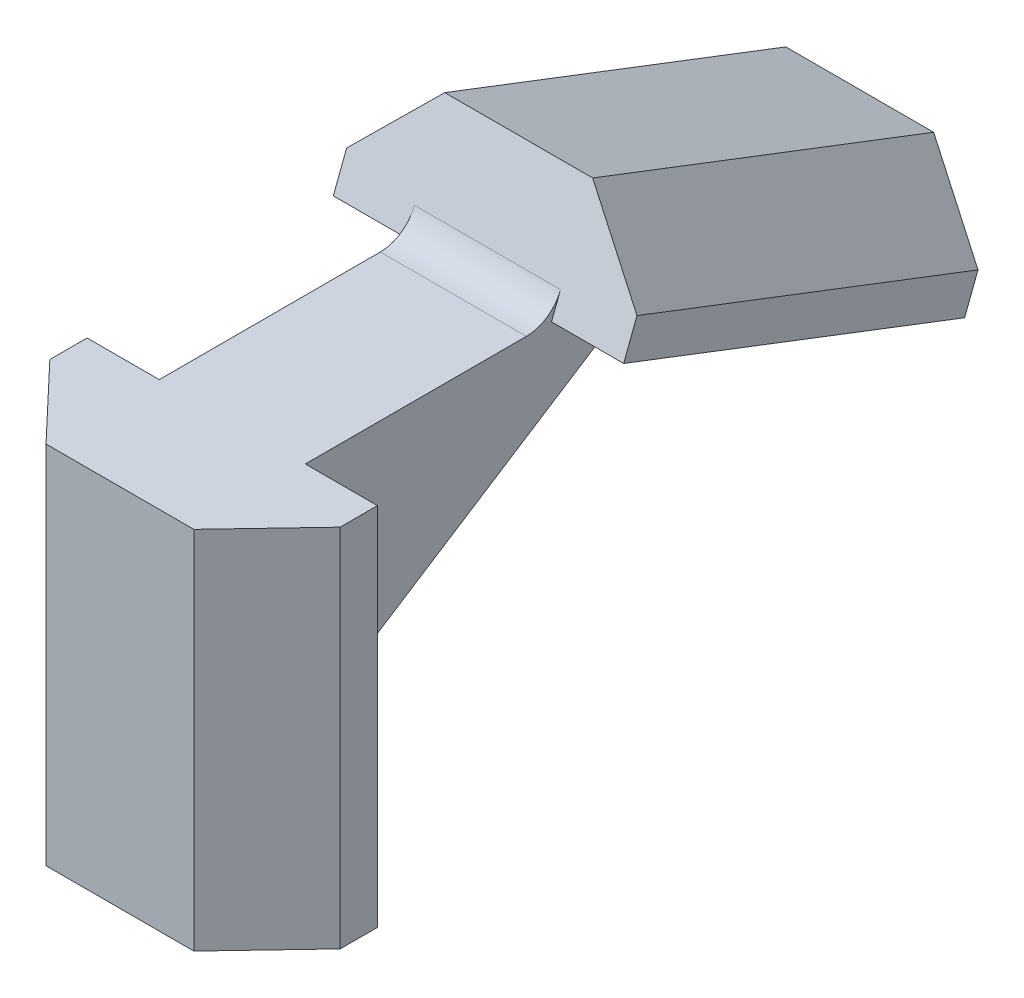
ISO-10303-21;
HEADER;
FILE_DESCRIPTION(('STEP AP214'),'2;1');
FILE_NAME('part.step','',(''),(''),'','','');
FILE_SCHEMA(('AUTOMOTIVE_DESIGN { 1 0 10303 214 1 1 1 1 }'));
ENDSEC;
DATA;
#1=APPLICATION_CONTEXT('core data for automotive mechanical design processes');
#2=APPLICATION_PROTOCOL_DEFINITION('international standard','automotive_design',2000,#1);
#3=PRODUCT_CONTEXT('',#1,'mechanical');
#4=PRODUCT('Part','Part','',(#3));
#5=PRODUCT_RELATED_PRODUCT_CATEGORY('part','',(#4));
#6=PRODUCT_DEFINITION_FORMATION('','',#4);
#7=PRODUCT_DEFINITION_CONTEXT('part definition',#1,'design');
#8=PRODUCT_DEFINITION('design','',#6,#7);
#9=PRODUCT_DEFINITION_SHAPE('','',#8);
#10=(LENGTH_UNIT() NAMED_UNIT(*) SI_UNIT(.MILLI.,.METRE.));
#11=(NAMED_UNIT(*) PLANE_ANGLE_UNIT() SI_UNIT($,.RADIAN.));
#12=(NAMED_UNIT(*) SI_UNIT($,.STERADIAN.) SOLID_ANGLE_UNIT());
#13=UNCERTAINTY_MEASURE_WITH_UNIT(LENGTH_MEASURE(1.E-05),#10,'distance_accuracy_value','');
#14=(GEOMETRIC_REPRESENTATION_CONTEXT(3) GLOBAL_UNCERTAINTY_ASSIGNED_CONTEXT((#13)) GLOBAL_UNIT_ASSIGNED_CONTEXT((#10,
#11,#12)) REPRESENTATION_CONTEXT('',''));
#15=CARTESIAN_POINT('',(0.,0.,0.));
#16=DIRECTION('',(0.,0.,1.));
#17=DIRECTION('',(1.,0.,0.));
#18=AXIS2_PLACEMENT_3D('',#15,#16,#17);
#19=CARTESIAN_POINT('',(-7.95,-20.,0.));
#20=DIRECTION('',(1.,0.,0.));
#21=DIRECTION('',(0.,0.,-1.));
#22=AXIS2_PLACEMENT_3D('',#19,#20,#21);
#23=PLANE('',#22);
#24=DIRECTION('',(0.,0.,-1.));
#25=VECTOR('',#24,1.);
#26=CARTESIAN_POINT('',(-7.95,0.,0.));
#27=LINE('',#26,#25);
#28=CARTESIAN_POINT('',(-7.95,0.,2.04));
#29=VERTEX_POINT('',#28);
#30=CARTESIAN_POINT('',(-7.95,0.,0.));
#31=VERTEX_POINT('',#30);
#32=EDGE_CURVE('E274',#29,#31,#27,.T.);
#33=ORIENTED_EDGE('',*,*,#32,.T.);
#34=DIRECTION('',(0.,1.,0.));
#35=VECTOR('',#34,1.);
#36=CARTESIAN_POINT('',(-7.95,-20.,0.));
#37=LINE('',#36,#35);
#38=CARTESIAN_POINT('',(-7.95,-20.,0.));
#39=VERTEX_POINT('',#38);
#40=EDGE_CURVE('E323',#39,#31,#37,.T.);
#41=ORIENTED_EDGE('',*,*,#40,.F.);
#42=DIRECTION('',(0.,0.,-1.));
#43=VECTOR('',#42,1.);
#44=CARTESIAN_POINT('',(-7.95,-20.,0.));
#45=LINE('',#44,#43);
#46=CARTESIAN_POINT('',(-7.95,-20.,2.04));
#47=VERTEX_POINT('',#46);
#48=EDGE_CURVE('E283',#47,#39,#45,.T.);
#49=ORIENTED_EDGE('',*,*,#48,.F.);
#50=DIRECTION('',(0.,1.,0.));
#51=VECTOR('',#50,1.);
#52=CARTESIAN_POINT('',(-7.95,-20.,2.04));
#53=LINE('',#52,#51);
#54=EDGE_CURVE('E303',#47,#29,#53,.T.);
#55=ORIENTED_EDGE('',*,*,#54,.T.);
#56=EDGE_LOOP('',(#33,#41,#49,#55));
#57=FACE_BOUND('',#56,.T.);
#58=ADVANCED_FACE('F42',(#57),#23,.F.);
#59=CARTESIAN_POINT('',(0.,-20.,0.));
#60=DIRECTION('',(0.,0.,1.));
#61=DIRECTION('',(1.,0.,0.));
#62=AXIS2_PLACEMENT_3D('',#59,#60,#61);
#63=PLANE('',#62);
#64=DIRECTION('',(0.,-1.,0.));
#65=VECTOR('',#64,1.);
#66=CARTESIAN_POINT('',(-4.,0.,0.));
#67=LINE('',#66,#65);
#68=CARTESIAN_POINT('',(-4.,0.,0.));
#69=VERTEX_POINT('',#68);
#70=CARTESIAN_POINT('',(-4.,-13.6329359020571,0.));
#71=VERTEX_POINT('',#70);
#72=EDGE_CURVE('E262',#69,#71,#67,.T.);
#73=ORIENTED_EDGE('',*,*,#72,.T.);
#74=DIRECTION('',(-1.,0.,0.));
#75=VECTOR('',#74,1.);
#76=CARTESIAN_POINT('',(4.,-13.6329359020571,0.));
#77=LINE('',#76,#75);
#78=CARTESIAN_POINT('',(4.,-13.632935902057,0.));
#79=VERTEX_POINT('',#78);
#80=EDGE_CURVE('E366',#71,#79,#77,.F.);
#81=ORIENTED_EDGE('',*,*,#80,.T.);
#82=DIRECTION('',(0.,-1.,0.));
#83=VECTOR('',#82,1.);
#84=CARTESIAN_POINT('',(4.,0.,0.));
#85=LINE('',#84,#83);
#86=CARTESIAN_POINT('',(4.,0.,0.));
#87=VERTEX_POINT('',#86);
#88=EDGE_CURVE('E263',#87,#79,#85,.T.);
#89=ORIENTED_EDGE('',*,*,#88,.F.);
#90=DIRECTION('',(1.,0.,0.));
#91=VECTOR('',#90,1.);
#92=CARTESIAN_POINT('',(0.,0.,0.));
#93=LINE('',#92,#91);
#94=CARTESIAN_POINT('',(7.95,0.,0.));
#95=VERTEX_POINT('',#94);
#96=EDGE_CURVE('E319',#87,#95,#93,.T.);
#97=ORIENTED_EDGE('',*,*,#96,.T.);
#98=DIRECTION('',(0.,1.,0.));
#99=VECTOR('',#98,1.);
#100=CARTESIAN_POINT('',(7.95,-20.,0.));
#101=LINE('',#100,#99);
#102=CARTESIAN_POINT('',(7.95,-20.,0.));
#103=VERTEX_POINT('',#102);
#104=EDGE_CURVE('E328',#103,#95,#101,.T.);
#105=ORIENTED_EDGE('',*,*,#104,.F.);
#106=DIRECTION('',(1.,0.,0.));
#107=VECTOR('',#106,1.);
#108=CARTESIAN_POINT('',(0.,-20.,0.));
#109=LINE('',#108,#107);
#110=EDGE_CURVE('E300',#39,#103,#109,.T.);
#111=ORIENTED_EDGE('',*,*,#110,.F.);
#112=ORIENTED_EDGE('',*,*,#40,.T.);
#113=EDGE_CURVE('E288',#31,#69,#93,.T.);
#114=ORIENTED_EDGE('',*,*,#113,.T.);
#115=EDGE_LOOP('',(#73,#81,#89,#97,#105,#111,#112,#114));
#116=FACE_BOUND('',#115,.T.);
#117=ADVANCED_FACE('F408',(#116),#63,.F.);
#118=CARTESIAN_POINT('',(7.95,-20.,0.));
#119=DIRECTION('',(-1.,0.,0.));
#120=DIRECTION('',(0.,0.,1.));
#121=AXIS2_PLACEMENT_3D('',#118,#119,#120);
#122=PLANE('',#121);
#123=DIRECTION('',(0.,0.,1.));
#124=VECTOR('',#123,1.);
#125=CARTESIAN_POINT('',(7.95,0.,0.));
#126=LINE('',#125,#124);
#127=CARTESIAN_POINT('',(7.95,0.,2.04));
#128=VERTEX_POINT('',#127);
#129=EDGE_CURVE('E316',#95,#128,#126,.T.);
#130=ORIENTED_EDGE('',*,*,#129,.T.);
#131=DIRECTION('',(0.,1.,0.));
#132=VECTOR('',#131,1.);
#133=CARTESIAN_POINT('',(7.95,-20.,2.04));
#134=LINE('',#133,#132);
#135=CARTESIAN_POINT('',(7.95,-20.,2.04));
#136=VERTEX_POINT('',#135);
#137=EDGE_CURVE('E332',#136,#128,#134,.T.);
#138=ORIENTED_EDGE('',*,*,#137,.F.);
#139=DIRECTION('',(0.,0.,1.));
#140=VECTOR('',#139,1.);
#141=CARTESIAN_POINT('',(7.95,-20.,0.));
#142=LINE('',#141,#140);
#143=EDGE_CURVE('E297',#103,#136,#142,.T.);
#144=ORIENTED_EDGE('',*,*,#143,.F.);
#145=ORIENTED_EDGE('',*,*,#104,.T.);
#146=EDGE_LOOP('',(#130,#138,#144,#145));
#147=FACE_BOUND('',#146,.T.);
#148=ADVANCED_FACE('F436',(#147),#122,.F.);
#149=CARTESIAN_POINT('',(5.20217481392665,-20.,4.93600140143796));
#150=DIRECTION('',(-0.725421588273714,0.,-0.688304815664138));
#151=DIRECTION('',(-0.688304815664138,0.,0.725421588273714));
#152=AXIS2_PLACEMENT_3D('',#149,#150,#151);
#153=PLANE('',#152);
#154=DIRECTION('',(-0.688304815664138,0.,0.725421588273714));
#155=VECTOR('',#154,1.);
#156=CARTESIAN_POINT('',(5.20217481392665,0.,4.93600140143796));
#157=LINE('',#156,#155);
#158=CARTESIAN_POINT('',(4.048,0.,6.15241498392368));
#159=VERTEX_POINT('',#158);
#160=EDGE_CURVE('E313',#128,#159,#157,.T.);
#161=ORIENTED_EDGE('',*,*,#160,.T.);
#162=DIRECTION('',(0.,1.,0.));
#163=VECTOR('',#162,1.);
#164=CARTESIAN_POINT('',(4.048,-20.,6.15241498392368));
#165=LINE('',#164,#163);
#166=CARTESIAN_POINT('',(4.048,-20.,6.15241498392368));
#167=VERTEX_POINT('',#166);
#168=EDGE_CURVE('E336',#167,#159,#165,.T.);
#169=ORIENTED_EDGE('',*,*,#168,.F.);
#170=DIRECTION('',(-0.688304815664138,0.,0.725421588273714));
#171=VECTOR('',#170,1.);
#172=CARTESIAN_POINT('',(5.20217481392665,-20.,4.93600140143796));
#173=LINE('',#172,#171);
#174=EDGE_CURVE('E294',#136,#167,#173,.T.);
#175=ORIENTED_EDGE('',*,*,#174,.F.);
#176=ORIENTED_EDGE('',*,*,#137,.T.);
#177=EDGE_LOOP('',(#161,#169,#175,#176));
#178=FACE_BOUND('',#177,.T.);
#179=ADVANCED_FACE('F440',(#178),#153,.F.);
#180=CARTESIAN_POINT('',(0.,-20.,6.15241498392368));
#181=DIRECTION('',(0.,0.,-1.));
#182=DIRECTION('',(-1.,0.,0.));
#183=AXIS2_PLACEMENT_3D('',#180,#181,#182);
#184=PLANE('',#183);
#185=DIRECTION('',(-1.,0.,0.));
#186=VECTOR('',#185,1.);
#187=CARTESIAN_POINT('',(0.,0.,6.15241498392368));
#188=LINE('',#187,#186);
#189=CARTESIAN_POINT('',(-4.048,0.,6.15241498392368));
#190=VERTEX_POINT('',#189);
#191=EDGE_CURVE('E310',#159,#190,#188,.T.);
#192=ORIENTED_EDGE('',*,*,#191,.T.);
#193=DIRECTION('',(0.,1.,0.));
#194=VECTOR('',#193,1.);
#195=CARTESIAN_POINT('',(-4.048,-20.,6.15241498392368));
#196=LINE('',#195,#194);
#197=CARTESIAN_POINT('',(-4.048,-20.,6.15241498392368));
#198=VERTEX_POINT('',#197);
#199=EDGE_CURVE('E340',#198,#190,#196,.T.);
#200=ORIENTED_EDGE('',*,*,#199,.F.);
#201=DIRECTION('',(-1.,0.,0.));
#202=VECTOR('',#201,1.);
#203=CARTESIAN_POINT('',(0.,-20.,6.15241498392368));
#204=LINE('',#203,#202);
#205=EDGE_CURVE('E291',#167,#198,#204,.T.);
#206=ORIENTED_EDGE('',*,*,#205,.F.);
#207=ORIENTED_EDGE('',*,*,#168,.T.);
#208=EDGE_LOOP('',(#192,#200,#206,#207));
#209=FACE_BOUND('',#208,.T.);
#210=ADVANCED_FACE('F453',(#209),#184,.F.);
#211=CARTESIAN_POINT('',(-5.20217481392665,-20.,4.93600140143796));
#212=DIRECTION('',(0.725421588273713,0.,-0.688304815664138));
#213=DIRECTION('',(-0.688304815664138,0.,-0.725421588273713));
#214=AXIS2_PLACEMENT_3D('',#211,#212,#213);
#215=PLANE('',#214);
#216=DIRECTION('',(-0.688304815664138,0.,-0.725421588273713));
#217=VECTOR('',#216,1.);
#218=CARTESIAN_POINT('',(-5.20217481392665,0.,4.93600140143796));
#219=LINE('',#218,#217);
#220=EDGE_CURVE('E307',#190,#29,#219,.T.);
#221=ORIENTED_EDGE('',*,*,#220,.T.);
#222=ORIENTED_EDGE('',*,*,#54,.F.);
#223=DIRECTION('',(-0.688304815664138,0.,-0.725421588273713));
#224=VECTOR('',#223,1.);
#225=CARTESIAN_POINT('',(-5.20217481392665,-20.,4.93600140143796));
#226=LINE('',#225,#224);
#227=EDGE_CURVE('E287',#198,#47,#226,.T.);
#228=ORIENTED_EDGE('',*,*,#227,.F.);
#229=ORIENTED_EDGE('',*,*,#199,.T.);
#230=EDGE_LOOP('',(#221,#222,#228,#229));
#231=FACE_BOUND('',#230,.T.);
#232=ADVANCED_FACE('F451',(#231),#215,.F.);
#233=CARTESIAN_POINT('',(0.,-20.,0.));
#234=DIRECTION('',(0.,1.,0.));
#235=DIRECTION('',(0.,0.,1.));
#236=AXIS2_PLACEMENT_3D('',#233,#234,#235);
#237=PLANE('',#236);
#238=ORIENTED_EDGE('',*,*,#48,.T.);
#239=ORIENTED_EDGE('',*,*,#110,.T.);
#240=ORIENTED_EDGE('',*,*,#143,.T.);
#241=ORIENTED_EDGE('',*,*,#174,.T.);
#242=ORIENTED_EDGE('',*,*,#205,.T.);
#243=ORIENTED_EDGE('',*,*,#227,.T.);
#244=EDGE_LOOP('',(#238,#239,#240,#241,#242,#243));
#245=FACE_BOUND('',#244,.T.);
#246=ADVANCED_FACE('F444',(#245),#237,.F.);
#247=CARTESIAN_POINT('',(0.,0.,0.));
#248=DIRECTION('',(0.,1.,0.));
#249=DIRECTION('',(0.,0.,1.));
#250=AXIS2_PLACEMENT_3D('',#247,#248,#249);
#251=PLANE('',#250);
#252=DIRECTION('',(0.,0.,1.));
#253=VECTOR('',#252,1.);
#254=CARTESIAN_POINT('',(4.,0.,0.));
#255=LINE('',#254,#253);
#256=CARTESIAN_POINT('',(4.,0.,-12.1065065335328));
#257=VERTEX_POINT('',#256);
#258=EDGE_CURVE('E271',#257,#87,#255,.T.);
#259=ORIENTED_EDGE('',*,*,#258,.F.);
#260=DIRECTION('',(-1.,0.,0.));
#261=VECTOR('',#260,1.);
#262=CARTESIAN_POINT('',(0.,0.,-12.1065065335328));
#263=LINE('',#262,#261);
#264=CARTESIAN_POINT('',(-4.,0.,-12.1065065335328));
#265=VERTEX_POINT('',#264);
#266=EDGE_CURVE('E327',#257,#265,#263,.T.);
#267=ORIENTED_EDGE('',*,*,#266,.T.);
#268=DIRECTION('',(0.,0.,1.));
#269=VECTOR('',#268,1.);
#270=CARTESIAN_POINT('',(-4.,0.,0.));
#271=LINE('',#270,#269);
#272=EDGE_CURVE('E267',#265,#69,#271,.T.);
#273=ORIENTED_EDGE('',*,*,#272,.T.);
#274=ORIENTED_EDGE('',*,*,#113,.F.);
#275=ORIENTED_EDGE('',*,*,#32,.F.);
#276=ORIENTED_EDGE('',*,*,#220,.F.);
#277=ORIENTED_EDGE('',*,*,#191,.F.);
#278=ORIENTED_EDGE('',*,*,#160,.F.);
#279=ORIENTED_EDGE('',*,*,#129,.F.);
#280=ORIENTED_EDGE('',*,*,#96,.F.);
#281=EDGE_LOOP('',(#259,#267,#273,#274,#275,#276,#277,#278,#279,#280));
#282=FACE_BOUND('',#281,.T.);
#283=ADVANCED_FACE('F414',(#282),#251,.T.);
#284=CARTESIAN_POINT('',(4.,-1.45753752555205,-17.2780835199325));
#285=DIRECTION('',(0.,0.841736094379975,0.539889199204749));
#286=DIRECTION('',(0.,-0.539889199204749,0.841736094379975));
#287=AXIS2_PLACEMENT_3D('',#284,#285,#286);
#288=PLANE('',#287);
#289=DIRECTION('',(0.,0.539889199204749,-0.841736094379975));
#290=VECTOR('',#289,1.);
#291=CARTESIAN_POINT('',(4.,-1.45753752555205,-17.2780835199325));
#292=LINE('',#291,#290);
#293=CARTESIAN_POINT('',(4.,-11.9494637132971,-0.920221601590498));
#294=VERTEX_POINT('',#293);
#295=CARTESIAN_POINT('',(4.,-2.00387315304792,-16.4262968607691));
#296=VERTEX_POINT('',#295);
#297=EDGE_CURVE('E266',#294,#296,#292,.T.);
#298=ORIENTED_EDGE('',*,*,#297,.F.);
#299=DIRECTION('',(-1.,0.,0.));
#300=VECTOR('',#299,1.);
#301=CARTESIAN_POINT('',(-4.,-11.9494637132971,-0.920221601590501));
#302=LINE('',#301,#300);
#303=CARTESIAN_POINT('',(-4.,-11.9494637132971,-0.920221601590498));
#304=VERTEX_POINT('',#303);
#305=EDGE_CURVE('E362',#294,#304,#302,.T.);
#306=ORIENTED_EDGE('',*,*,#305,.T.);
#307=DIRECTION('',(0.,0.539889199204749,-0.841736094379975));
#308=VECTOR('',#307,1.);
#309=CARTESIAN_POINT('',(-4.,-1.45753752555205,-17.2780835199325));
#310=LINE('',#309,#308);
#311=CARTESIAN_POINT('',(-4.,-2.00387315304792,-16.4262968607691));
#312=VERTEX_POINT('',#311);
#313=EDGE_CURVE('E277',#304,#312,#310,.T.);
#314=ORIENTED_EDGE('',*,*,#313,.T.);
#315=DIRECTION('',(-1.,0.,0.));
#316=VECTOR('',#315,1.);
#317=CARTESIAN_POINT('',(4.,-2.00387315304792,-16.4262968607691));
#318=LINE('',#317,#316);
#319=EDGE_CURVE('E359',#312,#296,#318,.F.);
#320=ORIENTED_EDGE('',*,*,#319,.T.);
#321=EDGE_LOOP('',(#298,#306,#314,#320));
#322=FACE_BOUND('',#321,.T.);
#323=ADVANCED_FACE('F395',(#322),#288,.F.);
#324=CARTESIAN_POINT('',(4.,0.,0.));
#325=DIRECTION('',(1.,0.,0.));
#326=DIRECTION('',(0.,0.,-1.));
#327=AXIS2_PLACEMENT_3D('',#324,#325,#326);
#328=PLANE('',#327);
#329=DIRECTION('',(0.,-0.358367949545304,-0.9335804264972));
#330=VECTOR('',#329,1.);
#331=CARTESIAN_POINT('',(4.,4.51029775340317,-1.73134109483254));
#332=LINE('',#331,#330);
#333=CARTESIAN_POINT('',(4.,0.,-13.481068450736));
#334=VERTEX_POINT('',#333);
#335=CARTESIAN_POINT('',(4.,-1.82018448881347,-18.2228111582692));
#336=VERTEX_POINT('',#335);
#337=EDGE_CURVE('E259',#334,#336,#332,.T.);
#338=ORIENTED_EDGE('',*,*,#337,.F.);
#339=DIRECTION('',(0.,-0.9335804264972,0.358367949545304));
#340=VECTOR('',#339,1.);
#341=CARTESIAN_POINT('',(4.,0.9335804264972,-13.8394364002813));
#342=LINE('',#341,#340);
#343=CARTESIAN_POINT('',(4.,1.28326410090939,-13.9736673865272));
#344=VERTEX_POINT('',#343);
#345=EDGE_CURVE('E350',#344,#334,#342,.T.);
#346=ORIENTED_EDGE('',*,*,#345,.F.);
#347=CARTESIAN_POINT('',(4.,2.,-12.1065065335328));
#348=DIRECTION('',(1.,0.,0.));
#349=DIRECTION('',(0.,0.,-1.));
#350=AXIS2_PLACEMENT_3D('',#347,#348,#349);
#351=CIRCLE('',#350,2.);
#352=EDGE_CURVE('E377',#344,#257,#351,.F.);
#353=ORIENTED_EDGE('',*,*,#352,.T.);
#354=ORIENTED_EDGE('',*,*,#258,.T.);
#355=ORIENTED_EDGE('',*,*,#88,.T.);
#356=CARTESIAN_POINT('',(4.,-13.6329359020571,-2.));
#357=DIRECTION('',(1.,0.,0.));
#358=DIRECTION('',(0.,0.,-1.));
#359=AXIS2_PLACEMENT_3D('',#356,#357,#358);
#360=CIRCLE('',#359,2.);
#361=EDGE_CURVE('E384',#79,#294,#360,.F.);
#362=ORIENTED_EDGE('',*,*,#361,.T.);
#363=ORIENTED_EDGE('',*,*,#297,.T.);
#364=CARTESIAN_POINT('',(4.,-3.68734534180787,-17.5060752591786));
#365=DIRECTION('',(1.,0.,0.));
#366=DIRECTION('',(0.,0.,-1.));
#367=AXIS2_PLACEMENT_3D('',#364,#365,#366);
#368=CIRCLE('',#367,2.);
#369=EDGE_CURVE('E11',#296,#336,#368,.F.);
#370=ORIENTED_EDGE('',*,*,#369,.T.);
#371=EDGE_LOOP('',(#338,#346,#353,#354,#355,#362,#363,#370));
#372=FACE_BOUND('',#371,.T.);
#373=ADVANCED_FACE('F400',(#372),#328,.T.);
#374=CARTESIAN_POINT('',(-4.,0.,0.));
#375=DIRECTION('',(1.,0.,0.));
#376=DIRECTION('',(0.,0.,-1.));
#377=AXIS2_PLACEMENT_3D('',#374,#375,#376);
#378=PLANE('',#377);
#379=ORIENTED_EDGE('',*,*,#272,.F.);
#380=CARTESIAN_POINT('',(-4.,2.,-12.1065065335328));
#381=DIRECTION('',(1.,0.,0.));
#382=DIRECTION('',(0.,0.,-1.));
#383=AXIS2_PLACEMENT_3D('',#380,#381,#382);
#384=CIRCLE('',#383,2.);
#385=CARTESIAN_POINT('',(-4.,1.28326410090939,-13.9736673865272));
#386=VERTEX_POINT('',#385);
#387=EDGE_CURVE('E374',#265,#386,#384,.T.);
#388=ORIENTED_EDGE('',*,*,#387,.T.);
#389=DIRECTION('',(0.,0.9335804264972,-0.358367949545304));
#390=VECTOR('',#389,1.);
#391=CARTESIAN_POINT('',(-4.,-4.51029775340317,-11.7497273559035));
#392=LINE('',#391,#390);
#393=CARTESIAN_POINT('',(-4.,0.,-13.481068450736));
#394=VERTEX_POINT('',#393);
#395=EDGE_CURVE('E58',#394,#386,#392,.T.);
#396=ORIENTED_EDGE('',*,*,#395,.F.);
#397=DIRECTION('',(0.,-0.358367949545304,-0.9335804264972));
#398=VECTOR('',#397,1.);
#399=CARTESIAN_POINT('',(-4.,4.51029775340317,-1.73134109483253));
#400=LINE('',#399,#398);
#401=CARTESIAN_POINT('',(-4.,-1.82018448881347,-18.2228111582692));
#402=VERTEX_POINT('',#401);
#403=EDGE_CURVE('E63',#394,#402,#400,.T.);
#404=ORIENTED_EDGE('',*,*,#403,.T.);
#405=CARTESIAN_POINT('',(-4.,-3.68734534180787,-17.5060752591786));
#406=DIRECTION('',(1.,0.,0.));
#407=DIRECTION('',(0.,0.,-1.));
#408=AXIS2_PLACEMENT_3D('',#405,#406,#407);
#409=CIRCLE('',#408,2.);
#410=EDGE_CURVE('E51',#402,#312,#409,.T.);
#411=ORIENTED_EDGE('',*,*,#410,.T.);
#412=ORIENTED_EDGE('',*,*,#313,.F.);
#413=CARTESIAN_POINT('',(-4.,-13.6329359020571,-2.));
#414=DIRECTION('',(1.,0.,0.));
#415=DIRECTION('',(0.,0.,-1.));
#416=AXIS2_PLACEMENT_3D('',#413,#414,#415);
#417=CIRCLE('',#416,2.);
#418=EDGE_CURVE('E380',#304,#71,#417,.T.);
#419=ORIENTED_EDGE('',*,*,#418,.T.);
#420=ORIENTED_EDGE('',*,*,#72,.F.);
#421=EDGE_LOOP('',(#379,#388,#396,#404,#411,#412,#419,#420));
#422=FACE_BOUND('',#421,.T.);
#423=ADVANCED_FACE('F389',(#422),#378,.F.);
#424=CARTESIAN_POINT('',(-4.,0.9335804264972,-13.8394364002813));
#425=DIRECTION('',(0.,-0.358367949545304,-0.9335804264972));
#426=DIRECTION('',(0.,0.9335804264972,-0.358367949545304));
#427=AXIS2_PLACEMENT_3D('',#424,#425,#426);
#428=PLANE('',#427);
#429=DIRECTION('',(1.,0.,0.));
#430=VECTOR('',#429,1.);
#431=CARTESIAN_POINT('',(7.95,0.,-13.481068450736));
#432=LINE('',#431,#430);
#433=CARTESIAN_POINT('',(-7.95,0.,-13.481068450736));
#434=VERTEX_POINT('',#433);
#435=EDGE_CURVE('E233',#434,#394,#432,.T.);
#436=ORIENTED_EDGE('',*,*,#435,.T.);
#437=ORIENTED_EDGE('',*,*,#395,.T.);
#438=DIRECTION('',(-1.,0.,0.));
#439=VECTOR('',#438,1.);
#440=CARTESIAN_POINT('',(-4.,1.28326410090939,-13.9736673865272));
#441=LINE('',#440,#439);
#442=EDGE_CURVE('E353',#386,#344,#441,.F.);
#443=ORIENTED_EDGE('',*,*,#442,.T.);
#444=ORIENTED_EDGE('',*,*,#345,.T.);
#445=CARTESIAN_POINT('',(7.95,0.,-13.481068450736));
#446=VERTEX_POINT('',#445);
#447=EDGE_CURVE('E232',#334,#446,#432,.T.);
#448=ORIENTED_EDGE('',*,*,#447,.T.);
#449=DIRECTION('',(0.,0.9335804264972,-0.358367949545304));
#450=VECTOR('',#449,1.);
#451=CARTESIAN_POINT('',(7.95,1.90450407005428,-14.2121390678084));
#452=LINE('',#451,#450);
#453=CARTESIAN_POINT('',(7.95,1.90450407005428,-14.2121390678084));
#454=VERTEX_POINT('',#453);
#455=EDGE_CURVE('E236',#446,#454,#452,.T.);
#456=ORIENTED_EDGE('',*,*,#455,.T.);
#457=DIRECTION('',(-0.688304815664138,0.67723939577085,-0.259967847145549));
#458=VECTOR('',#457,1.);
#459=CARTESIAN_POINT('',(4.048,5.74377420467923,-15.6858967932766));
#460=LINE('',#459,#458);
#461=CARTESIAN_POINT('',(4.048,5.74377420467923,-15.6858967932766));
#462=VERTEX_POINT('',#461);
#463=EDGE_CURVE('E212',#454,#462,#460,.T.);
#464=ORIENTED_EDGE('',*,*,#463,.T.);
#465=DIRECTION('',(-1.,0.,0.));
#466=VECTOR('',#465,1.);
#467=CARTESIAN_POINT('',(-4.048,5.74377420467923,-15.6858967932765));
#468=LINE('',#467,#466);
#469=CARTESIAN_POINT('',(-4.048,5.74377420467923,-15.6858967932765));
#470=VERTEX_POINT('',#469);
#471=EDGE_CURVE('E208',#462,#470,#468,.T.);
#472=ORIENTED_EDGE('',*,*,#471,.T.);
#473=DIRECTION('',(-0.688304815664138,-0.67723939577085,0.259967847145549));
#474=VECTOR('',#473,1.);
#475=CARTESIAN_POINT('',(-7.95,1.90450407005428,-14.2121390678084));
#476=LINE('',#475,#474);
#477=CARTESIAN_POINT('',(-7.95,1.90450407005428,-14.2121390678084));
#478=VERTEX_POINT('',#477);
#479=EDGE_CURVE('E227',#470,#478,#476,.T.);
#480=ORIENTED_EDGE('',*,*,#479,.T.);
#481=DIRECTION('',(0.,-0.9335804264972,0.358367949545304));
#482=VECTOR('',#481,1.);
#483=CARTESIAN_POINT('',(-7.95,0.,-13.481068450736));
#484=LINE('',#483,#482);
#485=EDGE_CURVE('E184',#478,#434,#484,.T.);
#486=ORIENTED_EDGE('',*,*,#485,.T.);
#487=EDGE_LOOP('',(#436,#437,#443,#444,#448,#456,#464,#472,#480,#486));
#488=FACE_BOUND('',#487,.T.);
#489=ADVANCED_FACE('F423',(#488),#428,.F.);
#490=CARTESIAN_POINT('',(-7.95,-5.2628549208518,-32.8837475977524));
#491=DIRECTION('',(-0.725421588273713,0.642587903367803,-0.246666385451716));
#492=DIRECTION('',(-0.663076669945793,-0.748551487723856,0.));
#493=AXIS2_PLACEMENT_3D('',#490,#491,#492);
#494=PLANE('',#493);
#495=ORIENTED_EDGE('',*,*,#479,.F.);
#496=DIRECTION('',(0.,0.358367949545304,0.9335804264972));
#497=VECTOR('',#496,1.);
#498=CARTESIAN_POINT('',(-4.048,-1.42358478622686,-34.3575053232206));
#499=LINE('',#498,#497);
#500=CARTESIAN_POINT('',(-4.048,-1.42358478622686,-34.3575053232206));
#501=VERTEX_POINT('',#500);
#502=EDGE_CURVE('E206',#501,#470,#499,.T.);
#503=ORIENTED_EDGE('',*,*,#502,.F.);
#504=DIRECTION('',(-0.688304815664138,-0.67723939577085,0.259967847145549));
#505=VECTOR('',#504,1.);
#506=CARTESIAN_POINT('',(-7.95,-5.2628549208518,-32.8837475977524));
#507=LINE('',#506,#505);
#508=CARTESIAN_POINT('',(-7.95,-5.2628549208518,-32.8837475977524));
#509=VERTEX_POINT('',#508);
#510=EDGE_CURVE('E198',#501,#509,#507,.T.);
#511=ORIENTED_EDGE('',*,*,#510,.T.);
#512=DIRECTION('',(0.,0.358367949545304,0.9335804264972));
#513=VECTOR('',#512,1.);
#514=CARTESIAN_POINT('',(-7.95,-5.2628549208518,-32.8837475977524));
#515=LINE('',#514,#513);
#516=EDGE_CURVE('E179',#509,#478,#515,.T.);
#517=ORIENTED_EDGE('',*,*,#516,.T.);
#518=EDGE_LOOP('',(#495,#503,#511,#517));
#519=FACE_BOUND('',#518,.T.);
#520=ADVANCED_FACE('F205',(#519),#494,.T.);
#521=CARTESIAN_POINT('',(-4.048,-1.42358478622686,-34.3575053232206));
#522=DIRECTION('',(0.,0.9335804264972,-0.358367949545304));
#523=DIRECTION('',(0.,0.358367949545304,0.9335804264972));
#524=AXIS2_PLACEMENT_3D('',#521,#522,#523);
#525=PLANE('',#524);
#526=ORIENTED_EDGE('',*,*,#471,.F.);
#527=DIRECTION('',(0.,0.358367949545304,0.9335804264972));
#528=VECTOR('',#527,1.);
#529=CARTESIAN_POINT('',(4.048,-1.42358478622685,-34.3575053232206));
#530=LINE('',#529,#528);
#531=CARTESIAN_POINT('',(4.048,-1.42358478622685,-34.3575053232206));
#532=VERTEX_POINT('',#531);
#533=EDGE_CURVE('E245',#532,#462,#530,.T.);
#534=ORIENTED_EDGE('',*,*,#533,.F.);
#535=DIRECTION('',(-1.,0.,0.));
#536=VECTOR('',#535,1.);
#537=CARTESIAN_POINT('',(-4.048,-1.42358478622686,-34.3575053232206));
#538=LINE('',#537,#536);
#539=EDGE_CURVE('E191',#532,#501,#538,.T.);
#540=ORIENTED_EDGE('',*,*,#539,.T.);
#541=ORIENTED_EDGE('',*,*,#502,.T.);
#542=EDGE_LOOP('',(#526,#534,#540,#541));
#543=FACE_BOUND('',#542,.T.);
#544=ADVANCED_FACE('F571',(#543),#525,.T.);
#545=CARTESIAN_POINT('',(4.048,-1.42358478622685,-34.3575053232206));
#546=DIRECTION('',(0.725421588273713,0.642587903367803,-0.246666385451716));
#547=DIRECTION('',(-0.663076669945793,0.748551487723856,0.));
#548=AXIS2_PLACEMENT_3D('',#545,#546,#547);
#549=PLANE('',#548);
#550=ORIENTED_EDGE('',*,*,#463,.F.);
#551=DIRECTION('',(0.,0.358367949545304,0.9335804264972));
#552=VECTOR('',#551,1.);
#553=CARTESIAN_POINT('',(7.95,-5.2628549208518,-32.8837475977524));
#554=LINE('',#553,#552);
#555=CARTESIAN_POINT('',(7.95,-5.2628549208518,-32.8837475977524));
#556=VERTEX_POINT('',#555);
#557=EDGE_CURVE('E248',#556,#454,#554,.T.);
#558=ORIENTED_EDGE('',*,*,#557,.F.);
#559=DIRECTION('',(-0.688304815664138,0.67723939577085,-0.259967847145549));
#560=VECTOR('',#559,1.);
#561=CARTESIAN_POINT('',(4.048,-1.42358478622685,-34.3575053232206));
#562=LINE('',#561,#560);
#563=EDGE_CURVE('E221',#556,#532,#562,.T.);
#564=ORIENTED_EDGE('',*,*,#563,.T.);
#565=ORIENTED_EDGE('',*,*,#533,.T.);
#566=EDGE_LOOP('',(#550,#558,#564,#565));
#567=FACE_BOUND('',#566,.T.);
#568=ADVANCED_FACE('F560',(#567),#549,.T.);
#569=CARTESIAN_POINT('',(7.95,-5.2628549208518,-32.8837475977524));
#570=DIRECTION('',(1.,0.,0.));
#571=DIRECTION('',(0.,1.,0.));
#572=AXIS2_PLACEMENT_3D('',#569,#570,#571);
#573=PLANE('',#572);
#574=ORIENTED_EDGE('',*,*,#455,.F.);
#575=DIRECTION('',(0.,0.358367949545304,0.9335804264972));
#576=VECTOR('',#575,1.);
#577=CARTESIAN_POINT('',(7.95,-7.16735899090609,-32.15267698068));
#578=LINE('',#577,#576);
#579=CARTESIAN_POINT('',(7.95,-7.16735899090609,-32.15267698068));
#580=VERTEX_POINT('',#579);
#581=EDGE_CURVE('E251',#580,#446,#578,.T.);
#582=ORIENTED_EDGE('',*,*,#581,.F.);
#583=DIRECTION('',(0.,0.9335804264972,-0.358367949545304));
#584=VECTOR('',#583,1.);
#585=CARTESIAN_POINT('',(7.95,-5.2628549208518,-32.8837475977524));
#586=LINE('',#585,#584);
#587=EDGE_CURVE('E217',#580,#556,#586,.T.);
#588=ORIENTED_EDGE('',*,*,#587,.T.);
#589=ORIENTED_EDGE('',*,*,#557,.T.);
#590=EDGE_LOOP('',(#574,#582,#588,#589));
#591=FACE_BOUND('',#590,.T.);
#592=ADVANCED_FACE('F500',(#591),#573,.T.);
#593=CARTESIAN_POINT('',(7.95,-7.16735899090609,-32.15267698068));
#594=DIRECTION('',(0.,-0.9335804264972,0.358367949545304));
#595=DIRECTION('',(0.,-0.358367949545304,-0.9335804264972));
#596=AXIS2_PLACEMENT_3D('',#593,#594,#595);
#597=PLANE('',#596);
#598=DIRECTION('',(-1.,0.,0.));
#599=VECTOR('',#598,1.);
#600=CARTESIAN_POINT('',(7.95,-1.82018448881347,-18.2228111582692));
#601=LINE('',#600,#599);
#602=EDGE_CURVE('E370',#336,#402,#601,.T.);
#603=ORIENTED_EDGE('',*,*,#602,.T.);
#604=ORIENTED_EDGE('',*,*,#403,.F.);
#605=ORIENTED_EDGE('',*,*,#435,.F.);
#606=DIRECTION('',(0.,0.358367949545304,0.9335804264972));
#607=VECTOR('',#606,1.);
#608=CARTESIAN_POINT('',(-7.95,-7.16735899090609,-32.15267698068));
#609=LINE('',#608,#607);
#610=CARTESIAN_POINT('',(-7.95,-7.16735899090609,-32.15267698068));
#611=VERTEX_POINT('',#610);
#612=EDGE_CURVE('E190',#611,#434,#609,.T.);
#613=ORIENTED_EDGE('',*,*,#612,.F.);
#614=DIRECTION('',(1.,0.,0.));
#615=VECTOR('',#614,1.);
#616=CARTESIAN_POINT('',(7.95,-7.16735899090609,-32.15267698068));
#617=LINE('',#616,#615);
#618=EDGE_CURVE('E202',#611,#580,#617,.T.);
#619=ORIENTED_EDGE('',*,*,#618,.T.);
#620=ORIENTED_EDGE('',*,*,#581,.T.);
#621=ORIENTED_EDGE('',*,*,#447,.F.);
#622=ORIENTED_EDGE('',*,*,#337,.T.);
#623=EDGE_LOOP('',(#603,#604,#605,#613,#619,#620,#621,#622));
#624=FACE_BOUND('',#623,.T.);
#625=ADVANCED_FACE('F426',(#624),#597,.T.);
#626=CARTESIAN_POINT('',(-7.95,-7.16735899090609,-32.15267698068));
#627=DIRECTION('',(-1.,0.,0.));
#628=DIRECTION('',(0.,-1.,0.));
#629=AXIS2_PLACEMENT_3D('',#626,#627,#628);
#630=PLANE('',#629);
#631=ORIENTED_EDGE('',*,*,#485,.F.);
#632=ORIENTED_EDGE('',*,*,#516,.F.);
#633=DIRECTION('',(0.,-0.9335804264972,0.358367949545304));
#634=VECTOR('',#633,1.);
#635=CARTESIAN_POINT('',(-7.95,-7.16735899090609,-32.15267698068));
#636=LINE('',#635,#634);
#637=EDGE_CURVE('E182',#509,#611,#636,.T.);
#638=ORIENTED_EDGE('',*,*,#637,.T.);
#639=ORIENTED_EDGE('',*,*,#612,.T.);
#640=EDGE_LOOP('',(#631,#632,#638,#639));
#641=FACE_BOUND('',#640,.T.);
#642=ADVANCED_FACE('F181',(#641),#630,.T.);
#643=CARTESIAN_POINT('',(0.,-11.6776567443093,-30.4213358858475));
#644=DIRECTION('',(0.,-0.358367949545304,-0.9335804264972));
#645=DIRECTION('',(0.,0.9335804264972,-0.358367949545304));
#646=AXIS2_PLACEMENT_3D('',#643,#644,#645);
#647=PLANE('',#646);
#648=ORIENTED_EDGE('',*,*,#510,.F.);
#649=ORIENTED_EDGE('',*,*,#539,.F.);
#650=ORIENTED_EDGE('',*,*,#563,.F.);
#651=ORIENTED_EDGE('',*,*,#587,.F.);
#652=ORIENTED_EDGE('',*,*,#618,.F.);
#653=ORIENTED_EDGE('',*,*,#637,.F.);
#654=EDGE_LOOP('',(#648,#649,#650,#651,#652,#653));
#655=FACE_BOUND('',#654,.T.);
#656=ADVANCED_FACE('F196',(#655),#647,.T.);
#657=CARTESIAN_POINT('',(0.,2.,-12.1065065335328));
#658=DIRECTION('',(-1.,0.,0.));
#659=DIRECTION('',(0.,0.,1.));
#660=AXIS2_PLACEMENT_3D('',#657,#658,#659);
#661=CYLINDRICAL_SURFACE('',#660,2.);
#662=ORIENTED_EDGE('',*,*,#352,.F.);
#663=ORIENTED_EDGE('',*,*,#442,.F.);
#664=ORIENTED_EDGE('',*,*,#387,.F.);
#665=ORIENTED_EDGE('',*,*,#266,.F.);
#666=EDGE_LOOP('',(#662,#663,#664,#665));
#667=FACE_BOUND('',#666,.T.);
#668=ADVANCED_FACE('F420',(#667),#661,.F.);
#669=CARTESIAN_POINT('',(4.,-13.6329359020571,-2.));
#670=DIRECTION('',(1.,0.,0.));
#671=DIRECTION('',(0.,0.,-1.));
#672=AXIS2_PLACEMENT_3D('',#669,#670,#671);
#673=CYLINDRICAL_SURFACE('',#672,2.);
#674=ORIENTED_EDGE('',*,*,#361,.F.);
#675=ORIENTED_EDGE('',*,*,#80,.F.);
#676=ORIENTED_EDGE('',*,*,#418,.F.);
#677=ORIENTED_EDGE('',*,*,#305,.F.);
#678=EDGE_LOOP('',(#674,#675,#676,#677));
#679=FACE_BOUND('',#678,.T.);
#680=ADVANCED_FACE('F404',(#679),#673,.F.);
#681=CARTESIAN_POINT('',(7.95,-3.68734534180787,-17.5060752591786));
#682=DIRECTION('',(-1.,0.,0.));
#683=DIRECTION('',(0.,0.,1.));
#684=AXIS2_PLACEMENT_3D('',#681,#682,#683);
#685=CYLINDRICAL_SURFACE('',#684,2.);
#686=ORIENTED_EDGE('',*,*,#369,.F.);
#687=ORIENTED_EDGE('',*,*,#319,.F.);
#688=ORIENTED_EDGE('',*,*,#410,.F.);
#689=ORIENTED_EDGE('',*,*,#602,.F.);
#690=EDGE_LOOP('',(#686,#687,#688,#689));
#691=FACE_BOUND('',#690,.T.);
#692=ADVANCED_FACE('F44',(#691),#685,.F.);
#693=CLOSED_SHELL('',(#58,#117,#148,#179,#210,#232,#246,#283,#323,#373,#423,#489,#520,#544,#568,
#592,#625,#642,#656,#668,#680,#692));
#694=MANIFOLD_SOLID_BREP('B2',#693);
#695=ADVANCED_BREP_SHAPE_REPRESENTATION('',(#18,#694),#14);
#696=SHAPE_DEFINITION_REPRESENTATION(#9,#695);
ENDSEC;
END-ISO-10303-21;
